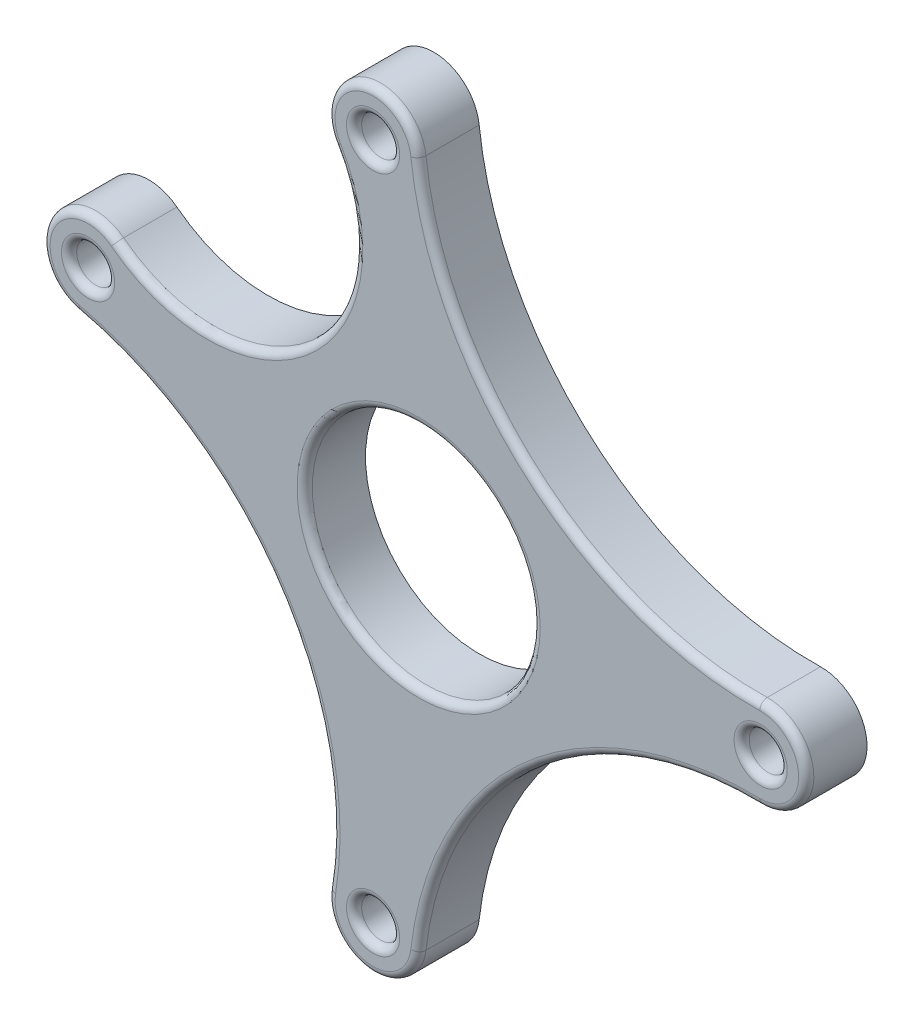
ISO-10303-21;
HEADER;
FILE_DESCRIPTION(('STEP AP214'),'2;1');
FILE_NAME('part.step','',(''),(''),'','','');
FILE_SCHEMA(('AUTOMOTIVE_DESIGN { 1 0 10303 214 1 1 1 1 }'));
ENDSEC;
DATA;
#1=APPLICATION_CONTEXT('core data for automotive mechanical design processes');
#2=APPLICATION_PROTOCOL_DEFINITION('international standard','automotive_design',2000,#1);
#3=PRODUCT_CONTEXT('',#1,'mechanical');
#4=PRODUCT('Part','Part','',(#3));
#5=PRODUCT_RELATED_PRODUCT_CATEGORY('part','',(#4));
#6=PRODUCT_DEFINITION_FORMATION('','',#4);
#7=PRODUCT_DEFINITION_CONTEXT('part definition',#1,'design');
#8=PRODUCT_DEFINITION('design','',#6,#7);
#9=PRODUCT_DEFINITION_SHAPE('','',#8);
#10=(LENGTH_UNIT() NAMED_UNIT(*) SI_UNIT(.MILLI.,.METRE.));
#11=(NAMED_UNIT(*) PLANE_ANGLE_UNIT() SI_UNIT($,.RADIAN.));
#12=(NAMED_UNIT(*) SI_UNIT($,.STERADIAN.) SOLID_ANGLE_UNIT());
#13=UNCERTAINTY_MEASURE_WITH_UNIT(LENGTH_MEASURE(1.E-05),#10,'distance_accuracy_value','');
#14=(GEOMETRIC_REPRESENTATION_CONTEXT(3) GLOBAL_UNCERTAINTY_ASSIGNED_CONTEXT((#13)) GLOBAL_UNIT_ASSIGNED_CONTEXT((#10,
#11,#12)) REPRESENTATION_CONTEXT('',''));
#15=CARTESIAN_POINT('',(0.,0.,0.));
#16=DIRECTION('',(0.,0.,1.));
#17=DIRECTION('',(1.,0.,0.));
#18=AXIS2_PLACEMENT_3D('',#15,#16,#17);
#19=CARTESIAN_POINT('',(-16.9268791414768,38.0226116454672,8.));
#20=DIRECTION('',(0.,0.,1.));
#21=DIRECTION('',(1.,0.,0.));
#22=AXIS2_PLACEMENT_3D('',#19,#20,#21);
#23=PLANE('',#22);
#24=CARTESIAN_POINT('',(-6.00000000030193,-44.6,8.));
#25=DIRECTION('',(0.,0.,1.));
#26=DIRECTION('',(1.,0.,0.));
#27=AXIS2_PLACEMENT_3D('',#24,#25,#26);
#28=CIRCLE('',#27,3.5);
#29=CARTESIAN_POINT('',(-2.50000000030193,-44.6,8.));
#30=VERTEX_POINT('',#29);
#31=EDGE_CURVE('E349',#30,#30,#28,.F.);
#32=ORIENTED_EDGE('',*,*,#31,.T.);
#33=EDGE_LOOP('',(#32));
#34=FACE_BOUND('',#33,.T.);
#35=CARTESIAN_POINT('',(-6.00000000030193,44.6,8.));
#36=DIRECTION('',(0.,0.,1.));
#37=DIRECTION('',(1.,0.,0.));
#38=AXIS2_PLACEMENT_3D('',#35,#36,#37);
#39=CIRCLE('',#38,3.5);
#40=CARTESIAN_POINT('',(-2.50000000030193,44.6,8.));
#41=VERTEX_POINT('',#40);
#42=EDGE_CURVE('E346',#41,#41,#39,.F.);
#43=ORIENTED_EDGE('',*,*,#42,.T.);
#44=EDGE_LOOP('',(#43));
#45=FACE_BOUND('',#44,.T.);
#46=CARTESIAN_POINT('',(44.9999999996981,0.,8.));
#47=DIRECTION('',(0.,0.,1.));
#48=DIRECTION('',(1.,0.,0.));
#49=AXIS2_PLACEMENT_3D('',#46,#47,#48);
#50=CIRCLE('',#49,5.);
#51=CARTESIAN_POINT('',(44.8967986852033,-4.99893483541108,8.));
#52=VERTEX_POINT('',#51);
#53=CARTESIAN_POINT('',(44.8967986852033,4.99893483541111,8.));
#54=VERTEX_POINT('',#53);
#55=EDGE_CURVE('E341',#52,#54,#50,.T.);
#56=ORIENTED_EDGE('',*,*,#55,.T.);
#57=CARTESIAN_POINT('',(43.9621432270299,50.2724059325992,8.));
#58=DIRECTION('',(0.,0.,1.));
#59=DIRECTION('',(1.,0.,0.));
#60=AXIS2_PLACEMENT_3D('',#57,#58,#59);
#61=CIRCLE('',#60,45.2831178919188);
#62=CARTESIAN_POINT('',(-1.03191674274389,45.1640467586747,8.));
#63=VERTEX_POINT('',#62);
#64=EDGE_CURVE('E343',#54,#63,#61,.F.);
#65=ORIENTED_EDGE('',*,*,#64,.T.);
#66=CARTESIAN_POINT('',(-6.00000000030193,44.6,8.));
#67=DIRECTION('',(0.,0.,1.));
#68=DIRECTION('',(1.,0.,0.));
#69=AXIS2_PLACEMENT_3D('',#66,#67,#68);
#70=CIRCLE('',#69,5.);
#71=CARTESIAN_POINT('',(-10.2837829854321,42.0213950794452,8.));
#72=VERTEX_POINT('',#71);
#73=EDGE_CURVE('E329',#63,#72,#70,.T.);
#74=ORIENTED_EDGE('',*,*,#73,.T.);
#75=CARTESIAN_POINT('',(-27.8537582826517,31.4452232909344,8.));
#76=DIRECTION('',(0.,0.,1.));
#77=DIRECTION('',(1.,0.,0.));
#78=AXIS2_PLACEMENT_3D('',#75,#76,#77);
#79=CIRCLE('',#78,20.5075459683746);
#80=CARTESIAN_POINT('',(-40.4330170500313,15.2488752300812,8.));
#81=VERTEX_POINT('',#80);
#82=EDGE_CURVE('E331',#72,#81,#79,.F.);
#83=ORIENTED_EDGE('',*,*,#82,.T.);
#84=CARTESIAN_POINT('',(-43.500000000302,11.3,8.));
#85=DIRECTION('',(0.,0.,1.));
#86=DIRECTION('',(1.,0.,0.));
#87=AXIS2_PLACEMENT_3D('',#84,#85,#86);
#88=CIRCLE('',#87,5.);
#89=CARTESIAN_POINT('',(-44.6191321767987,6.42685489939714,8.));
#90=VERTEX_POINT('',#89);
#91=EDGE_CURVE('E333',#81,#90,#88,.T.);
#92=ORIENTED_EDGE('',*,*,#91,.T.);
#93=CARTESIAN_POINT('',(-54.5024848852916,-36.6091803790181,8.));
#94=DIRECTION('',(0.,0.,1.));
#95=DIRECTION('',(1.,0.,0.));
#96=AXIS2_PLACEMENT_3D('',#93,#94,#95);
#97=CIRCLE('',#96,44.1563244988244);
#98=CARTESIAN_POINT('',(-10.9334938466685,-43.7872033047169,8.));
#99=VERTEX_POINT('',#98);
#100=EDGE_CURVE('E335',#90,#99,#97,.F.);
#101=ORIENTED_EDGE('',*,*,#100,.T.);
#102=CARTESIAN_POINT('',(-6.00000000030193,-44.6,8.));
#103=DIRECTION('',(0.,0.,1.));
#104=DIRECTION('',(1.,0.,0.));
#105=AXIS2_PLACEMENT_3D('',#102,#103,#104);
#106=CIRCLE('',#105,4.99999999999999);
#107=CARTESIAN_POINT('',(-1.03191674274389,-45.1640467586747,8.));
#108=VERTEX_POINT('',#107);
#109=EDGE_CURVE('E337',#99,#108,#106,.T.);
#110=ORIENTED_EDGE('',*,*,#109,.T.);
#111=CARTESIAN_POINT('',(43.96214322703,-50.2724059325993,8.));
#112=DIRECTION('',(0.,0.,1.));
#113=DIRECTION('',(1.,0.,0.));
#114=AXIS2_PLACEMENT_3D('',#111,#112,#113);
#115=CIRCLE('',#114,45.2831178919189);
#116=EDGE_CURVE('E339',#108,#52,#115,.F.);
#117=ORIENTED_EDGE('',*,*,#116,.T.);
#118=EDGE_LOOP('',(#56,#65,#74,#83,#92,#101,#110,#117));
#119=FACE_BOUND('',#118,.T.);
#120=CARTESIAN_POINT('',(-43.500000000302,11.3,8.));
#121=DIRECTION('',(0.,0.,1.));
#122=DIRECTION('',(1.,0.,0.));
#123=AXIS2_PLACEMENT_3D('',#120,#121,#122);
#124=CIRCLE('',#123,3.5);
#125=CARTESIAN_POINT('',(-40.000000000302,11.3,8.));
#126=VERTEX_POINT('',#125);
#127=EDGE_CURVE('E326',#126,#126,#124,.F.);
#128=ORIENTED_EDGE('',*,*,#127,.T.);
#129=EDGE_LOOP('',(#128));
#130=FACE_BOUND('',#129,.T.);
#131=CARTESIAN_POINT('',(44.9999999996981,0.,8.));
#132=DIRECTION('',(0.,0.,1.));
#133=DIRECTION('',(1.,0.,0.));
#134=AXIS2_PLACEMENT_3D('',#131,#132,#133);
#135=CIRCLE('',#134,3.5);
#136=CARTESIAN_POINT('',(48.4999999996981,0.,8.));
#137=VERTEX_POINT('',#136);
#138=EDGE_CURVE('E323',#137,#137,#135,.F.);
#139=ORIENTED_EDGE('',*,*,#138,.T.);
#140=EDGE_LOOP('',(#139));
#141=FACE_BOUND('',#140,.T.);
#142=CARTESIAN_POINT('',(0.,0.,8.));
#143=DIRECTION('',(0.,0.,1.));
#144=DIRECTION('',(1.,0.,0.));
#145=AXIS2_PLACEMENT_3D('',#142,#143,#144);
#146=CIRCLE('',#145,16.);
#147=CARTESIAN_POINT('',(16.,0.,8.));
#148=VERTEX_POINT('',#147);
#149=EDGE_CURVE('E317',#148,#148,#146,.F.);
#150=ORIENTED_EDGE('',*,*,#149,.T.);
#151=EDGE_LOOP('',(#150));
#152=FACE_BOUND('',#151,.T.);
#153=ADVANCED_FACE('F169',(#34,#45,#119,#130,#141,#152),#23,.T.);
#154=CARTESIAN_POINT('',(-16.9268791414768,38.0226116454672,0.));
#155=DIRECTION('',(0.,0.,1.));
#156=DIRECTION('',(1.,0.,0.));
#157=AXIS2_PLACEMENT_3D('',#154,#155,#156);
#158=PLANE('',#157);
#159=CARTESIAN_POINT('',(-6.00000000030193,44.6,0.));
#160=DIRECTION('',(0.,0.,1.));
#161=DIRECTION('',(1.,0.,0.));
#162=AXIS2_PLACEMENT_3D('',#159,#160,#161);
#163=CIRCLE('',#162,6.);
#164=CARTESIAN_POINT('',(-0.0383000912322767,45.2768561104097,0.));
#165=VERTEX_POINT('',#164);
#166=CARTESIAN_POINT('',(-11.1405395824581,41.5056740953343,0.));
#167=VERTEX_POINT('',#166);
#168=EDGE_CURVE('E270',#165,#167,#163,.T.);
#169=ORIENTED_EDGE('',*,*,#168,.F.);
#170=CARTESIAN_POINT('',(43.9621432270299,50.2724059325992,0.));
#171=DIRECTION('',(0.,0.,1.));
#172=DIRECTION('',(1.,0.,0.));
#173=AXIS2_PLACEMENT_3D('',#170,#171,#172);
#174=CIRCLE('',#173,44.2831178919188);
#175=CARTESIAN_POINT('',(44.8761584223044,5.99872180249333,0.));
#176=VERTEX_POINT('',#175);
#177=EDGE_CURVE('E301',#165,#176,#174,.T.);
#178=ORIENTED_EDGE('',*,*,#177,.T.);
#179=CARTESIAN_POINT('',(44.9999999996981,0.,0.));
#180=DIRECTION('',(0.,0.,1.));
#181=DIRECTION('',(1.,0.,0.));
#182=AXIS2_PLACEMENT_3D('',#179,#180,#181);
#183=CIRCLE('',#182,6.);
#184=CARTESIAN_POINT('',(44.8761584223044,-5.9987218024933,0.));
#185=VERTEX_POINT('',#184);
#186=EDGE_CURVE('E298',#185,#176,#183,.T.);
#187=ORIENTED_EDGE('',*,*,#186,.F.);
#188=CARTESIAN_POINT('',(43.96214322703,-50.2724059325993,0.));
#189=DIRECTION('',(0.,0.,1.));
#190=DIRECTION('',(1.,0.,0.));
#191=AXIS2_PLACEMENT_3D('',#188,#189,#190);
#192=CIRCLE('',#191,44.2831178919189);
#193=CARTESIAN_POINT('',(-0.0383000912322837,-45.2768561104097,0.));
#194=VERTEX_POINT('',#193);
#195=EDGE_CURVE('E295',#185,#194,#192,.T.);
#196=ORIENTED_EDGE('',*,*,#195,.T.);
#197=CARTESIAN_POINT('',(-6.00000000030193,-44.6,0.));
#198=DIRECTION('',(0.,0.,1.));
#199=DIRECTION('',(1.,0.,0.));
#200=AXIS2_PLACEMENT_3D('',#197,#198,#199);
#201=CIRCLE('',#200,5.99999999999999);
#202=CARTESIAN_POINT('',(-11.9201926159418,-43.6246439656602,0.));
#203=VERTEX_POINT('',#202);
#204=EDGE_CURVE('E292',#203,#194,#201,.T.);
#205=ORIENTED_EDGE('',*,*,#204,.F.);
#206=CARTESIAN_POINT('',(-54.5024848852916,-36.6091803790181,0.));
#207=DIRECTION('',(0.,0.,-1.));
#208=DIRECTION('',(-1.,0.,0.));
#209=AXIS2_PLACEMENT_3D('',#206,#207,#208);
#210=CIRCLE('',#209,43.1563244988244);
#211=CARTESIAN_POINT('',(-44.842958612098,5.45222587927657,0.));
#212=VERTEX_POINT('',#211);
#213=EDGE_CURVE('E286',#212,#203,#210,.T.);
#214=ORIENTED_EDGE('',*,*,#213,.F.);
#215=CARTESIAN_POINT('',(-43.500000000302,11.3,0.));
#216=DIRECTION('',(0.,0.,1.));
#217=DIRECTION('',(1.,0.,0.));
#218=AXIS2_PLACEMENT_3D('',#215,#216,#217);
#219=CIRCLE('',#218,6.);
#220=CARTESIAN_POINT('',(-39.8196204599771,16.0386502760974,0.));
#221=VERTEX_POINT('',#220);
#222=EDGE_CURVE('E284',#221,#212,#219,.T.);
#223=ORIENTED_EDGE('',*,*,#222,.F.);
#224=CARTESIAN_POINT('',(-27.8537582826517,31.4452232909344,0.));
#225=DIRECTION('',(0.,0.,1.));
#226=DIRECTION('',(1.,0.,0.));
#227=AXIS2_PLACEMENT_3D('',#224,#225,#226);
#228=CIRCLE('',#227,19.5075459683746);
#229=EDGE_CURVE('E263',#221,#167,#228,.T.);
#230=ORIENTED_EDGE('',*,*,#229,.T.);
#231=EDGE_LOOP('',(#169,#178,#187,#196,#205,#214,#223,#230));
#232=FACE_BOUND('',#231,.T.);
#233=CARTESIAN_POINT('',(0.,0.,0.));
#234=DIRECTION('',(0.,0.,1.));
#235=DIRECTION('',(1.,0.,0.));
#236=AXIS2_PLACEMENT_3D('',#233,#234,#235);
#237=CIRCLE('',#236,15.);
#238=CARTESIAN_POINT('',(15.,0.,0.));
#239=VERTEX_POINT('',#238);
#240=EDGE_CURVE('E277',#239,#239,#237,.T.);
#241=ORIENTED_EDGE('',*,*,#240,.T.);
#242=EDGE_LOOP('',(#241));
#243=FACE_BOUND('',#242,.T.);
#244=CARTESIAN_POINT('',(-43.500000000302,11.3,0.));
#245=DIRECTION('',(0.,0.,1.));
#246=DIRECTION('',(1.,0.,0.));
#247=AXIS2_PLACEMENT_3D('',#244,#245,#246);
#248=CIRCLE('',#247,2.5);
#249=CARTESIAN_POINT('',(-41.000000000302,11.3,0.));
#250=VERTEX_POINT('',#249);
#251=EDGE_CURVE('E409',#250,#250,#248,.T.);
#252=ORIENTED_EDGE('',*,*,#251,.T.);
#253=EDGE_LOOP('',(#252));
#254=FACE_BOUND('',#253,.T.);
#255=CARTESIAN_POINT('',(-6.00000000030193,44.6,0.));
#256=DIRECTION('',(0.,0.,1.));
#257=DIRECTION('',(1.,0.,0.));
#258=AXIS2_PLACEMENT_3D('',#255,#256,#257);
#259=CIRCLE('',#258,2.5);
#260=CARTESIAN_POINT('',(-3.50000000030193,44.6,0.));
#261=VERTEX_POINT('',#260);
#262=EDGE_CURVE('E404',#261,#261,#259,.T.);
#263=ORIENTED_EDGE('',*,*,#262,.T.);
#264=EDGE_LOOP('',(#263));
#265=FACE_BOUND('',#264,.T.);
#266=CARTESIAN_POINT('',(44.9999999996981,0.,0.));
#267=DIRECTION('',(0.,0.,1.));
#268=DIRECTION('',(1.,0.,0.));
#269=AXIS2_PLACEMENT_3D('',#266,#267,#268);
#270=CIRCLE('',#269,2.5);
#271=CARTESIAN_POINT('',(47.4999999996981,0.,0.));
#272=VERTEX_POINT('',#271);
#273=EDGE_CURVE('E399',#272,#272,#270,.T.);
#274=ORIENTED_EDGE('',*,*,#273,.T.);
#275=EDGE_LOOP('',(#274));
#276=FACE_BOUND('',#275,.T.);
#277=CARTESIAN_POINT('',(-6.00000000030193,-44.6,0.));
#278=DIRECTION('',(0.,0.,1.));
#279=DIRECTION('',(1.,0.,0.));
#280=AXIS2_PLACEMENT_3D('',#277,#278,#279);
#281=CIRCLE('',#280,2.5);
#282=CARTESIAN_POINT('',(-3.50000000030193,-44.6,0.));
#283=VERTEX_POINT('',#282);
#284=EDGE_CURVE('E394',#283,#283,#281,.T.);
#285=ORIENTED_EDGE('',*,*,#284,.T.);
#286=EDGE_LOOP('',(#285));
#287=FACE_BOUND('',#286,.T.);
#288=ADVANCED_FACE('F280',(#232,#243,#254,#265,#276,#287),#158,.F.);
#289=CARTESIAN_POINT('',(-6.00000000030193,44.6,8.));
#290=DIRECTION('',(0.,0.,-1.));
#291=DIRECTION('',(-1.,0.,0.));
#292=AXIS2_PLACEMENT_3D('',#289,#290,#291);
#293=CYLINDRICAL_SURFACE('',#292,6.);
#294=DIRECTION('',(0.,0.,-1.));
#295=VECTOR('',#294,1.);
#296=CARTESIAN_POINT('',(-11.1405395824581,41.5056740953343,8.));
#297=LINE('',#296,#295);
#298=CARTESIAN_POINT('',(-11.1405395824581,41.5056740953343,7.));
#299=VERTEX_POINT('',#298);
#300=EDGE_CURVE('E259',#299,#167,#297,.T.);
#301=ORIENTED_EDGE('',*,*,#300,.F.);
#302=CARTESIAN_POINT('',(-6.00000000030193,44.6,7.));
#303=DIRECTION('',(0.,0.,1.));
#304=DIRECTION('',(1.,0.,0.));
#305=AXIS2_PLACEMENT_3D('',#302,#303,#304);
#306=CIRCLE('',#305,6.);
#307=CARTESIAN_POINT('',(-0.0383000912322767,45.2768561104097,7.));
#308=VERTEX_POINT('',#307);
#309=EDGE_CURVE('E368',#299,#308,#306,.F.);
#310=ORIENTED_EDGE('',*,*,#309,.T.);
#311=DIRECTION('',(0.,0.,-1.));
#312=VECTOR('',#311,1.);
#313=CARTESIAN_POINT('',(-0.0383000912322767,45.2768561104097,8.));
#314=LINE('',#313,#312);
#315=EDGE_CURVE('E273',#308,#165,#314,.T.);
#316=ORIENTED_EDGE('',*,*,#315,.T.);
#317=ORIENTED_EDGE('',*,*,#168,.T.);
#318=EDGE_LOOP('',(#301,#310,#316,#317));
#319=FACE_BOUND('',#318,.T.);
#320=ADVANCED_FACE('F271',(#319),#293,.T.);
#321=CARTESIAN_POINT('',(-27.8537582826517,31.4452232909344,8.));
#322=DIRECTION('',(0.,0.,-1.));
#323=DIRECTION('',(-1.,0.,0.));
#324=AXIS2_PLACEMENT_3D('',#321,#322,#323);
#325=CYLINDRICAL_SURFACE('',#324,19.5075459683746);
#326=DIRECTION('',(0.,0.,-1.));
#327=VECTOR('',#326,1.);
#328=CARTESIAN_POINT('',(-39.8196204599771,16.0386502760974,8.));
#329=LINE('',#328,#327);
#330=CARTESIAN_POINT('',(-39.8196204599771,16.0386502760974,7.));
#331=VERTEX_POINT('',#330);
#332=EDGE_CURVE('E267',#331,#221,#329,.T.);
#333=ORIENTED_EDGE('',*,*,#332,.F.);
#334=CARTESIAN_POINT('',(-27.8537582826517,31.4452232909344,7.));
#335=DIRECTION('',(0.,0.,1.));
#336=DIRECTION('',(1.,0.,0.));
#337=AXIS2_PLACEMENT_3D('',#334,#335,#336);
#338=CIRCLE('',#337,19.5075459683746);
#339=EDGE_CURVE('E186',#331,#299,#338,.T.);
#340=ORIENTED_EDGE('',*,*,#339,.T.);
#341=ORIENTED_EDGE('',*,*,#300,.T.);
#342=ORIENTED_EDGE('',*,*,#229,.F.);
#343=EDGE_LOOP('',(#333,#340,#341,#342));
#344=FACE_BOUND('',#343,.T.);
#345=ADVANCED_FACE('F261',(#344),#325,.F.);
#346=CARTESIAN_POINT('',(-43.500000000302,11.3,8.));
#347=DIRECTION('',(0.,0.,-1.));
#348=DIRECTION('',(-1.,0.,0.));
#349=AXIS2_PLACEMENT_3D('',#346,#347,#348);
#350=CYLINDRICAL_SURFACE('',#349,6.);
#351=DIRECTION('',(0.,0.,-1.));
#352=VECTOR('',#351,1.);
#353=CARTESIAN_POINT('',(-44.842958612098,5.45222587927657,8.));
#354=LINE('',#353,#352);
#355=CARTESIAN_POINT('',(-44.842958612098,5.45222587927657,7.));
#356=VERTEX_POINT('',#355);
#357=EDGE_CURVE('E312',#356,#212,#354,.T.);
#358=ORIENTED_EDGE('',*,*,#357,.F.);
#359=CARTESIAN_POINT('',(-43.500000000302,11.3,7.));
#360=DIRECTION('',(0.,0.,1.));
#361=DIRECTION('',(1.,0.,0.));
#362=AXIS2_PLACEMENT_3D('',#359,#360,#361);
#363=CIRCLE('',#362,6.);
#364=EDGE_CURVE('E194',#356,#331,#363,.F.);
#365=ORIENTED_EDGE('',*,*,#364,.T.);
#366=ORIENTED_EDGE('',*,*,#332,.T.);
#367=ORIENTED_EDGE('',*,*,#222,.T.);
#368=EDGE_LOOP('',(#358,#365,#366,#367));
#369=FACE_BOUND('',#368,.T.);
#370=ADVANCED_FACE('F454',(#369),#350,.T.);
#371=CARTESIAN_POINT('',(-54.5024848852916,-36.6091803790181,8.));
#372=DIRECTION('',(0.,0.,-1.));
#373=DIRECTION('',(-1.,0.,0.));
#374=AXIS2_PLACEMENT_3D('',#371,#372,#373);
#375=CYLINDRICAL_SURFACE('',#374,43.1563244988244);
#376=DIRECTION('',(0.,0.,-1.));
#377=VECTOR('',#376,1.);
#378=CARTESIAN_POINT('',(-11.9201926159418,-43.6246439656602,8.));
#379=LINE('',#378,#377);
#380=CARTESIAN_POINT('',(-11.9201926159418,-43.6246439656602,7.));
#381=VERTEX_POINT('',#380);
#382=EDGE_CURVE('E310',#381,#203,#379,.T.);
#383=ORIENTED_EDGE('',*,*,#382,.F.);
#384=CARTESIAN_POINT('',(-54.5024848852916,-36.6091803790181,7.));
#385=DIRECTION('',(0.,0.,1.));
#386=DIRECTION('',(1.,0.,0.));
#387=AXIS2_PLACEMENT_3D('',#384,#385,#386);
#388=CIRCLE('',#387,43.1563244988244);
#389=EDGE_CURVE('E364',#381,#356,#388,.T.);
#390=ORIENTED_EDGE('',*,*,#389,.T.);
#391=ORIENTED_EDGE('',*,*,#357,.T.);
#392=ORIENTED_EDGE('',*,*,#213,.T.);
#393=EDGE_LOOP('',(#383,#390,#391,#392));
#394=FACE_BOUND('',#393,.T.);
#395=ADVANCED_FACE('F450',(#394),#375,.F.);
#396=CARTESIAN_POINT('',(-6.00000000030193,-44.6,8.));
#397=DIRECTION('',(0.,0.,-1.));
#398=DIRECTION('',(-1.,0.,0.));
#399=AXIS2_PLACEMENT_3D('',#396,#397,#398);
#400=CYLINDRICAL_SURFACE('',#399,5.99999999999999);
#401=DIRECTION('',(0.,0.,-1.));
#402=VECTOR('',#401,1.);
#403=CARTESIAN_POINT('',(-0.0383000912322837,-45.2768561104097,8.));
#404=LINE('',#403,#402);
#405=CARTESIAN_POINT('',(-0.0383000912322837,-45.2768561104097,7.));
#406=VERTEX_POINT('',#405);
#407=EDGE_CURVE('E308',#406,#194,#404,.T.);
#408=ORIENTED_EDGE('',*,*,#407,.F.);
#409=CARTESIAN_POINT('',(-6.00000000030193,-44.6,7.));
#410=DIRECTION('',(0.,0.,1.));
#411=DIRECTION('',(1.,0.,0.));
#412=AXIS2_PLACEMENT_3D('',#409,#410,#411);
#413=CIRCLE('',#412,5.99999999999999);
#414=EDGE_CURVE('E362',#406,#381,#413,.F.);
#415=ORIENTED_EDGE('',*,*,#414,.T.);
#416=ORIENTED_EDGE('',*,*,#382,.T.);
#417=ORIENTED_EDGE('',*,*,#204,.T.);
#418=EDGE_LOOP('',(#408,#415,#416,#417));
#419=FACE_BOUND('',#418,.T.);
#420=ADVANCED_FACE('F446',(#419),#400,.T.);
#421=CARTESIAN_POINT('',(43.96214322703,-50.2724059325993,8.));
#422=DIRECTION('',(0.,0.,-1.));
#423=DIRECTION('',(-1.,0.,0.));
#424=AXIS2_PLACEMENT_3D('',#421,#422,#423);
#425=CYLINDRICAL_SURFACE('',#424,44.2831178919189);
#426=DIRECTION('',(0.,0.,-1.));
#427=VECTOR('',#426,1.);
#428=CARTESIAN_POINT('',(44.8761584223044,-5.9987218024933,8.));
#429=LINE('',#428,#427);
#430=CARTESIAN_POINT('',(44.8761584223044,-5.9987218024933,7.));
#431=VERTEX_POINT('',#430);
#432=EDGE_CURVE('E306',#431,#185,#429,.T.);
#433=ORIENTED_EDGE('',*,*,#432,.F.);
#434=CARTESIAN_POINT('',(43.96214322703,-50.2724059325993,7.));
#435=DIRECTION('',(0.,0.,1.));
#436=DIRECTION('',(1.,0.,0.));
#437=AXIS2_PLACEMENT_3D('',#434,#435,#436);
#438=CIRCLE('',#437,44.2831178919189);
#439=EDGE_CURVE('E360',#431,#406,#438,.T.);
#440=ORIENTED_EDGE('',*,*,#439,.T.);
#441=ORIENTED_EDGE('',*,*,#407,.T.);
#442=ORIENTED_EDGE('',*,*,#195,.F.);
#443=EDGE_LOOP('',(#433,#440,#441,#442));
#444=FACE_BOUND('',#443,.T.);
#445=ADVANCED_FACE('F442',(#444),#425,.F.);
#446=CARTESIAN_POINT('',(44.9999999996981,0.,8.));
#447=DIRECTION('',(0.,0.,-1.));
#448=DIRECTION('',(-1.,0.,0.));
#449=AXIS2_PLACEMENT_3D('',#446,#447,#448);
#450=CYLINDRICAL_SURFACE('',#449,6.);
#451=DIRECTION('',(0.,0.,-1.));
#452=VECTOR('',#451,1.);
#453=CARTESIAN_POINT('',(44.8761584223044,5.99872180249333,8.));
#454=LINE('',#453,#452);
#455=CARTESIAN_POINT('',(44.8761584223044,5.99872180249333,7.));
#456=VERTEX_POINT('',#455);
#457=EDGE_CURVE('E304',#456,#176,#454,.T.);
#458=ORIENTED_EDGE('',*,*,#457,.F.);
#459=CARTESIAN_POINT('',(44.9999999996981,0.,7.));
#460=DIRECTION('',(0.,0.,1.));
#461=DIRECTION('',(1.,0.,0.));
#462=AXIS2_PLACEMENT_3D('',#459,#460,#461);
#463=CIRCLE('',#462,6.);
#464=EDGE_CURVE('E358',#456,#431,#463,.F.);
#465=ORIENTED_EDGE('',*,*,#464,.T.);
#466=ORIENTED_EDGE('',*,*,#432,.T.);
#467=ORIENTED_EDGE('',*,*,#186,.T.);
#468=EDGE_LOOP('',(#458,#465,#466,#467));
#469=FACE_BOUND('',#468,.T.);
#470=ADVANCED_FACE('F428',(#469),#450,.T.);
#471=CARTESIAN_POINT('',(43.9621432270299,50.2724059325992,8.));
#472=DIRECTION('',(0.,0.,-1.));
#473=DIRECTION('',(-1.,0.,0.));
#474=AXIS2_PLACEMENT_3D('',#471,#472,#473);
#475=CYLINDRICAL_SURFACE('',#474,44.2831178919188);
#476=ORIENTED_EDGE('',*,*,#315,.F.);
#477=CARTESIAN_POINT('',(43.9621432270299,50.2724059325992,7.));
#478=DIRECTION('',(0.,0.,1.));
#479=DIRECTION('',(1.,0.,0.));
#480=AXIS2_PLACEMENT_3D('',#477,#478,#479);
#481=CIRCLE('',#480,44.2831178919188);
#482=EDGE_CURVE('E355',#308,#456,#481,.T.);
#483=ORIENTED_EDGE('',*,*,#482,.T.);
#484=ORIENTED_EDGE('',*,*,#457,.T.);
#485=ORIENTED_EDGE('',*,*,#177,.F.);
#486=EDGE_LOOP('',(#476,#483,#484,#485));
#487=FACE_BOUND('',#486,.T.);
#488=ADVANCED_FACE('F418',(#487),#475,.F.);
#489=CARTESIAN_POINT('',(0.,0.,8.));
#490=DIRECTION('',(0.,0.,-1.));
#491=DIRECTION('',(-1.,0.,0.));
#492=AXIS2_PLACEMENT_3D('',#489,#490,#491);
#493=CYLINDRICAL_SURFACE('',#492,15.);
#494=CARTESIAN_POINT('',(0.,0.,7.));
#495=DIRECTION('',(0.,0.,1.));
#496=DIRECTION('',(1.,0.,0.));
#497=AXIS2_PLACEMENT_3D('',#494,#495,#496);
#498=CIRCLE('',#497,15.);
#499=CARTESIAN_POINT('',(15.,0.,7.));
#500=VERTEX_POINT('',#499);
#501=EDGE_CURVE('E266',#500,#500,#498,.T.);
#502=ORIENTED_EDGE('',*,*,#501,.T.);
#503=EDGE_LOOP('',(#502));
#504=FACE_BOUND('',#503,.T.);
#505=ORIENTED_EDGE('',*,*,#240,.F.);
#506=EDGE_LOOP('',(#505));
#507=FACE_BOUND('',#506,.T.);
#508=ADVANCED_FACE('F415',(#504,#507),#493,.F.);
#509=CARTESIAN_POINT('',(-43.500000000302,11.3,8.));
#510=DIRECTION('',(0.,0.,-1.));
#511=DIRECTION('',(-1.,0.,0.));
#512=AXIS2_PLACEMENT_3D('',#509,#510,#511);
#513=CYLINDRICAL_SURFACE('',#512,2.5);
#514=CARTESIAN_POINT('',(-43.500000000302,11.3,7.));
#515=DIRECTION('',(0.,0.,1.));
#516=DIRECTION('',(1.,0.,0.));
#517=AXIS2_PLACEMENT_3D('',#514,#515,#516);
#518=CIRCLE('',#517,2.5);
#519=CARTESIAN_POINT('',(-41.000000000302,11.3,7.));
#520=VERTEX_POINT('',#519);
#521=EDGE_CURVE('E178',#520,#520,#518,.T.);
#522=ORIENTED_EDGE('',*,*,#521,.T.);
#523=EDGE_LOOP('',(#522));
#524=FACE_BOUND('',#523,.T.);
#525=ORIENTED_EDGE('',*,*,#251,.F.);
#526=EDGE_LOOP('',(#525));
#527=FACE_BOUND('',#526,.T.);
#528=ADVANCED_FACE('F417',(#524,#527),#513,.F.);
#529=CARTESIAN_POINT('',(-6.00000000030193,44.6,8.));
#530=DIRECTION('',(0.,0.,-1.));
#531=DIRECTION('',(-1.,0.,0.));
#532=AXIS2_PLACEMENT_3D('',#529,#530,#531);
#533=CYLINDRICAL_SURFACE('',#532,2.5);
#534=CARTESIAN_POINT('',(-6.00000000030193,44.6,7.));
#535=DIRECTION('',(0.,0.,1.));
#536=DIRECTION('',(1.,0.,0.));
#537=AXIS2_PLACEMENT_3D('',#534,#535,#536);
#538=CIRCLE('',#537,2.5);
#539=CARTESIAN_POINT('',(-3.50000000030193,44.6,7.));
#540=VERTEX_POINT('',#539);
#541=EDGE_CURVE('E352',#540,#540,#538,.T.);
#542=ORIENTED_EDGE('',*,*,#541,.T.);
#543=EDGE_LOOP('',(#542));
#544=FACE_BOUND('',#543,.T.);
#545=ORIENTED_EDGE('',*,*,#262,.F.);
#546=EDGE_LOOP('',(#545));
#547=FACE_BOUND('',#546,.T.);
#548=ADVANCED_FACE('F425',(#544,#547),#533,.F.);
#549=CARTESIAN_POINT('',(44.9999999996981,0.,8.));
#550=DIRECTION('',(0.,0.,-1.));
#551=DIRECTION('',(-1.,0.,0.));
#552=AXIS2_PLACEMENT_3D('',#549,#550,#551);
#553=CYLINDRICAL_SURFACE('',#552,2.5);
#554=CARTESIAN_POINT('',(44.9999999996981,0.,7.));
#555=DIRECTION('',(0.,0.,1.));
#556=DIRECTION('',(1.,0.,0.));
#557=AXIS2_PLACEMENT_3D('',#554,#555,#556);
#558=CIRCLE('',#557,2.5);
#559=CARTESIAN_POINT('',(47.4999999996981,0.,7.));
#560=VERTEX_POINT('',#559);
#561=EDGE_CURVE('E12',#560,#560,#558,.T.);
#562=ORIENTED_EDGE('',*,*,#561,.T.);
#563=EDGE_LOOP('',(#562));
#564=FACE_BOUND('',#563,.T.);
#565=ORIENTED_EDGE('',*,*,#273,.F.);
#566=EDGE_LOOP('',(#565));
#567=FACE_BOUND('',#566,.T.);
#568=ADVANCED_FACE('F521',(#564,#567),#553,.F.);
#569=CARTESIAN_POINT('',(-6.00000000030193,-44.6,8.));
#570=DIRECTION('',(0.,0.,-1.));
#571=DIRECTION('',(-1.,0.,0.));
#572=AXIS2_PLACEMENT_3D('',#569,#570,#571);
#573=CYLINDRICAL_SURFACE('',#572,2.5);
#574=CARTESIAN_POINT('',(-6.00000000030193,-44.6,7.));
#575=DIRECTION('',(0.,0.,1.));
#576=DIRECTION('',(1.,0.,0.));
#577=AXIS2_PLACEMENT_3D('',#574,#575,#576);
#578=CIRCLE('',#577,2.5);
#579=CARTESIAN_POINT('',(-3.50000000030193,-44.6,7.));
#580=VERTEX_POINT('',#579);
#581=EDGE_CURVE('E320',#580,#580,#578,.T.);
#582=ORIENTED_EDGE('',*,*,#581,.T.);
#583=EDGE_LOOP('',(#582));
#584=FACE_BOUND('',#583,.T.);
#585=ORIENTED_EDGE('',*,*,#284,.F.);
#586=EDGE_LOOP('',(#585));
#587=FACE_BOUND('',#586,.T.);
#588=ADVANCED_FACE('F466',(#584,#587),#573,.F.);
#589=CARTESIAN_POINT('',(0.,0.,7.));
#590=DIRECTION('',(0.,0.,1.));
#591=DIRECTION('',(1.,0.,0.));
#592=AXIS2_PLACEMENT_3D('',#589,#590,#591);
#593=TOROIDAL_SURFACE('',#592,16.,1.);
#594=ORIENTED_EDGE('',*,*,#149,.F.);
#595=EDGE_LOOP('',(#594));
#596=FACE_BOUND('',#595,.T.);
#597=ORIENTED_EDGE('',*,*,#501,.F.);
#598=EDGE_LOOP('',(#597));
#599=FACE_BOUND('',#598,.T.);
#600=ADVANCED_FACE('F462',(#596,#599),#593,.T.);
#601=CARTESIAN_POINT('',(-6.00000000030193,-44.6,7.));
#602=DIRECTION('',(0.,0.,1.));
#603=DIRECTION('',(1.,0.,0.));
#604=AXIS2_PLACEMENT_3D('',#601,#602,#603);
#605=TOROIDAL_SURFACE('',#604,3.5,1.);
#606=ORIENTED_EDGE('',*,*,#31,.F.);
#607=EDGE_LOOP('',(#606));
#608=FACE_BOUND('',#607,.T.);
#609=ORIENTED_EDGE('',*,*,#581,.F.);
#610=EDGE_LOOP('',(#609));
#611=FACE_BOUND('',#610,.T.);
#612=ADVANCED_FACE('F465',(#608,#611),#605,.T.);
#613=CARTESIAN_POINT('',(-6.00000000030193,44.6,7.));
#614=DIRECTION('',(0.,0.,1.));
#615=DIRECTION('',(1.,0.,0.));
#616=AXIS2_PLACEMENT_3D('',#613,#614,#615);
#617=TOROIDAL_SURFACE('',#616,3.5,1.);
#618=ORIENTED_EDGE('',*,*,#42,.F.);
#619=EDGE_LOOP('',(#618));
#620=FACE_BOUND('',#619,.T.);
#621=ORIENTED_EDGE('',*,*,#541,.F.);
#622=EDGE_LOOP('',(#621));
#623=FACE_BOUND('',#622,.T.);
#624=ADVANCED_FACE('F470',(#620,#623),#617,.T.);
#625=CARTESIAN_POINT('',(-54.5024848852916,-36.6091803790181,7.));
#626=DIRECTION('',(0.,0.,1.));
#627=DIRECTION('',(1.,0.,0.));
#628=AXIS2_PLACEMENT_3D('',#625,#626,#627);
#629=TOROIDAL_SURFACE('',#628,44.1563244988244,1.);
#630=CARTESIAN_POINT('',(-10.9334938466685,-43.7872033047169,7.));
#631=DIRECTION('',(-0.162559339056622,-0.986698769273315,0.));
#632=DIRECTION('',(0.986698769273315,-0.162559339056622,0.));
#633=AXIS2_PLACEMENT_3D('',#630,#631,#632);
#634=CIRCLE('',#633,1.);
#635=EDGE_CURVE('E387',#99,#381,#634,.T.);
#636=ORIENTED_EDGE('',*,*,#635,.F.);
#637=ORIENTED_EDGE('',*,*,#100,.F.);
#638=CARTESIAN_POINT('',(-44.6191321767987,6.42685489939715,7.));
#639=DIRECTION('',(-0.974629020120574,0.223826435299342,0.));
#640=DIRECTION('',(-0.223826435299342,-0.974629020120574,0.));
#641=AXIS2_PLACEMENT_3D('',#638,#639,#640);
#642=CIRCLE('',#641,1.);
#643=EDGE_CURVE('E173',#356,#90,#642,.T.);
#644=ORIENTED_EDGE('',*,*,#643,.F.);
#645=ORIENTED_EDGE('',*,*,#389,.F.);
#646=EDGE_LOOP('',(#636,#637,#644,#645));
#647=FACE_BOUND('',#646,.T.);
#648=ADVANCED_FACE('F474',(#647),#629,.T.);
#649=CARTESIAN_POINT('',(-43.500000000302,11.3,7.));
#650=DIRECTION('',(0.,0.,1.));
#651=DIRECTION('',(1.,0.,0.));
#652=AXIS2_PLACEMENT_3D('',#649,#650,#651);
#653=TOROIDAL_SURFACE('',#652,5.,1.);
#654=ORIENTED_EDGE('',*,*,#643,.T.);
#655=ORIENTED_EDGE('',*,*,#91,.F.);
#656=CARTESIAN_POINT('',(-40.4330170500313,15.2488752300812,7.));
#657=DIRECTION('',(0.789775046016235,-0.613396590054145,0.));
#658=DIRECTION('',(0.613396590054145,0.789775046016236,0.));
#659=AXIS2_PLACEMENT_3D('',#656,#657,#658);
#660=CIRCLE('',#659,1.);
#661=EDGE_CURVE('E385',#331,#81,#660,.T.);
#662=ORIENTED_EDGE('',*,*,#661,.F.);
#663=ORIENTED_EDGE('',*,*,#364,.F.);
#664=EDGE_LOOP('',(#654,#655,#662,#663));
#665=FACE_BOUND('',#664,.T.);
#666=ADVANCED_FACE('F500',(#665),#653,.T.);
#667=CARTESIAN_POINT('',(-6.00000000030193,-44.6,7.));
#668=DIRECTION('',(0.,0.,1.));
#669=DIRECTION('',(1.,0.,0.));
#670=AXIS2_PLACEMENT_3D('',#667,#668,#669);
#671=TOROIDAL_SURFACE('',#670,4.99999999999999,1.);
#672=ORIENTED_EDGE('',*,*,#635,.T.);
#673=ORIENTED_EDGE('',*,*,#414,.F.);
#674=CARTESIAN_POINT('',(-1.03191674274389,-45.1640467586747,7.));
#675=DIRECTION('',(0.112809351734945,0.993616651511609,0.));
#676=DIRECTION('',(-0.993616651511609,0.112809351734945,0.));
#677=AXIS2_PLACEMENT_3D('',#674,#675,#676);
#678=CIRCLE('',#677,1.);
#679=EDGE_CURVE('E382',#108,#406,#678,.T.);
#680=ORIENTED_EDGE('',*,*,#679,.F.);
#681=ORIENTED_EDGE('',*,*,#109,.F.);
#682=EDGE_LOOP('',(#672,#673,#680,#681));
#683=FACE_BOUND('',#682,.T.);
#684=ADVANCED_FACE('F496',(#683),#671,.T.);
#685=CARTESIAN_POINT('',(-27.8537582826517,31.4452232909344,7.));
#686=DIRECTION('',(0.,0.,1.));
#687=DIRECTION('',(1.,0.,0.));
#688=AXIS2_PLACEMENT_3D('',#685,#686,#687);
#689=TOROIDAL_SURFACE('',#688,20.5075459683746,1.);
#690=ORIENTED_EDGE('',*,*,#661,.T.);
#691=ORIENTED_EDGE('',*,*,#82,.F.);
#692=CARTESIAN_POINT('',(-10.2837829854321,42.0213950794452,7.));
#693=DIRECTION('',(-0.515720984110956,0.856756597026032,0.));
#694=DIRECTION('',(-0.856756597026032,-0.515720984110956,0.));
#695=AXIS2_PLACEMENT_3D('',#692,#693,#694);
#696=CIRCLE('',#695,1.);
#697=EDGE_CURVE('E379',#299,#72,#696,.T.);
#698=ORIENTED_EDGE('',*,*,#697,.F.);
#699=ORIENTED_EDGE('',*,*,#339,.F.);
#700=EDGE_LOOP('',(#690,#691,#698,#699));
#701=FACE_BOUND('',#700,.T.);
#702=ADVANCED_FACE('F492',(#701),#689,.T.);
#703=CARTESIAN_POINT('',(43.96214322703,-50.2724059325993,7.));
#704=DIRECTION('',(0.,0.,1.));
#705=DIRECTION('',(1.,0.,0.));
#706=AXIS2_PLACEMENT_3D('',#703,#704,#705);
#707=TOROIDAL_SURFACE('',#706,45.2831178919189,1.);
#708=ORIENTED_EDGE('',*,*,#679,.T.);
#709=ORIENTED_EDGE('',*,*,#439,.F.);
#710=CARTESIAN_POINT('',(44.8967986852033,-4.99893483541108,7.));
#711=DIRECTION('',(0.999786967082219,-0.0206402628989481,0.));
#712=DIRECTION('',(0.0206402628989481,0.999786967082219,0.));
#713=AXIS2_PLACEMENT_3D('',#710,#711,#712);
#714=CIRCLE('',#713,1.);
#715=EDGE_CURVE('E376',#52,#431,#714,.T.);
#716=ORIENTED_EDGE('',*,*,#715,.F.);
#717=ORIENTED_EDGE('',*,*,#116,.F.);
#718=EDGE_LOOP('',(#708,#709,#716,#717));
#719=FACE_BOUND('',#718,.T.);
#720=ADVANCED_FACE('F488',(#719),#707,.T.);
#721=CARTESIAN_POINT('',(-6.00000000030193,44.6,7.));
#722=DIRECTION('',(0.,0.,1.));
#723=DIRECTION('',(1.,0.,0.));
#724=AXIS2_PLACEMENT_3D('',#721,#722,#723);
#725=TOROIDAL_SURFACE('',#724,5.,1.);
#726=ORIENTED_EDGE('',*,*,#697,.T.);
#727=ORIENTED_EDGE('',*,*,#73,.F.);
#728=CARTESIAN_POINT('',(-1.03191674274389,45.1640467586747,7.));
#729=DIRECTION('',(0.112809351734945,-0.993616651511609,0.));
#730=DIRECTION('',(0.993616651511609,0.112809351734945,0.));
#731=AXIS2_PLACEMENT_3D('',#728,#729,#730);
#732=CIRCLE('',#731,1.);
#733=EDGE_CURVE('E374',#308,#63,#732,.T.);
#734=ORIENTED_EDGE('',*,*,#733,.F.);
#735=ORIENTED_EDGE('',*,*,#309,.F.);
#736=EDGE_LOOP('',(#726,#727,#734,#735));
#737=FACE_BOUND('',#736,.T.);
#738=ADVANCED_FACE('F484',(#737),#725,.T.);
#739=CARTESIAN_POINT('',(44.9999999996981,0.,7.));
#740=DIRECTION('',(0.,0.,1.));
#741=DIRECTION('',(1.,0.,0.));
#742=AXIS2_PLACEMENT_3D('',#739,#740,#741);
#743=TOROIDAL_SURFACE('',#742,5.,1.);
#744=ORIENTED_EDGE('',*,*,#715,.T.);
#745=ORIENTED_EDGE('',*,*,#464,.F.);
#746=CARTESIAN_POINT('',(44.8967986852033,4.99893483541111,7.));
#747=DIRECTION('',(-0.999786967082219,-0.020640262898948,0.));
#748=DIRECTION('',(0.020640262898948,-0.999786967082219,0.));
#749=AXIS2_PLACEMENT_3D('',#746,#747,#748);
#750=CIRCLE('',#749,1.);
#751=EDGE_CURVE('E372',#54,#456,#750,.T.);
#752=ORIENTED_EDGE('',*,*,#751,.F.);
#753=ORIENTED_EDGE('',*,*,#55,.F.);
#754=EDGE_LOOP('',(#744,#745,#752,#753));
#755=FACE_BOUND('',#754,.T.);
#756=ADVANCED_FACE('F480',(#755),#743,.T.);
#757=CARTESIAN_POINT('',(43.9621432270299,50.2724059325992,7.));
#758=DIRECTION('',(0.,0.,1.));
#759=DIRECTION('',(1.,0.,0.));
#760=AXIS2_PLACEMENT_3D('',#757,#758,#759);
#761=TOROIDAL_SURFACE('',#760,45.2831178919188,1.);
#762=ORIENTED_EDGE('',*,*,#733,.T.);
#763=ORIENTED_EDGE('',*,*,#64,.F.);
#764=ORIENTED_EDGE('',*,*,#751,.T.);
#765=ORIENTED_EDGE('',*,*,#482,.F.);
#766=EDGE_LOOP('',(#762,#763,#764,#765));
#767=FACE_BOUND('',#766,.T.);
#768=ADVANCED_FACE('F476',(#767),#761,.T.);
#769=CARTESIAN_POINT('',(-43.500000000302,11.3,7.));
#770=DIRECTION('',(0.,0.,1.));
#771=DIRECTION('',(1.,0.,0.));
#772=AXIS2_PLACEMENT_3D('',#769,#770,#771);
#773=TOROIDAL_SURFACE('',#772,3.5,1.);
#774=ORIENTED_EDGE('',*,*,#127,.F.);
#775=EDGE_LOOP('',(#774));
#776=FACE_BOUND('',#775,.T.);
#777=ORIENTED_EDGE('',*,*,#521,.F.);
#778=EDGE_LOOP('',(#777));
#779=FACE_BOUND('',#778,.T.);
#780=ADVANCED_FACE('F479',(#776,#779),#773,.T.);
#781=CARTESIAN_POINT('',(44.9999999996981,0.,7.));
#782=DIRECTION('',(0.,0.,1.));
#783=DIRECTION('',(1.,0.,0.));
#784=AXIS2_PLACEMENT_3D('',#781,#782,#783);
#785=TOROIDAL_SURFACE('',#784,3.5,1.);
#786=ORIENTED_EDGE('',*,*,#138,.F.);
#787=EDGE_LOOP('',(#786));
#788=FACE_BOUND('',#787,.T.);
#789=ORIENTED_EDGE('',*,*,#561,.F.);
#790=EDGE_LOOP('',(#789));
#791=FACE_BOUND('',#790,.T.);
#792=ADVANCED_FACE('F171',(#788,#791),#785,.T.);
#793=CLOSED_SHELL('',(#153,#288,#320,#345,#370,#395,#420,#445,#470,#488,#508,#528,#548,#568,
#588,#600,#612,#624,#648,#666,#684,#702,#720,#738,#756,#768,#780,#792));
#794=MANIFOLD_SOLID_BREP('B2',#793);
#795=ADVANCED_BREP_SHAPE_REPRESENTATION('',(#18,#794),#14);
#796=SHAPE_DEFINITION_REPRESENTATION(#9,#795);
ENDSEC;
END-ISO-10303-21;
